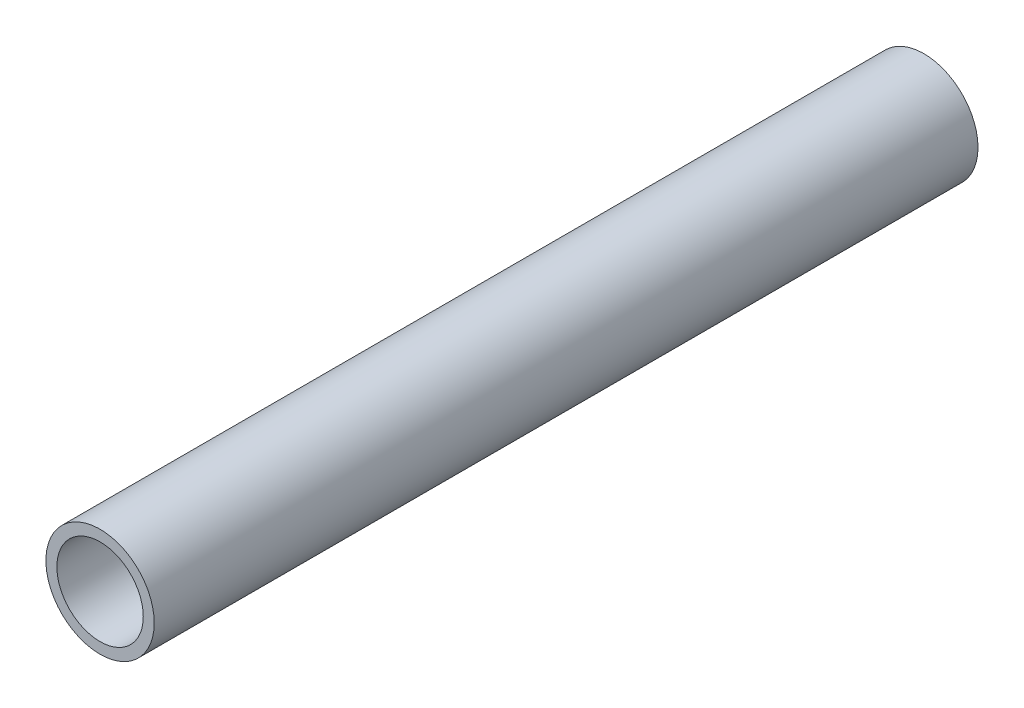
ISO-10303-21;
HEADER;
FILE_DESCRIPTION(('STEP AP214'),'2;1');
FILE_NAME('part.step','',(''),(''),'','','');
FILE_SCHEMA(('AUTOMOTIVE_DESIGN { 1 0 10303 214 1 1 1 1 }'));
ENDSEC;
DATA;
#1=APPLICATION_CONTEXT('core data for automotive mechanical design processes');
#2=APPLICATION_PROTOCOL_DEFINITION('international standard','automotive_design',2000,#1);
#3=PRODUCT_CONTEXT('',#1,'mechanical');
#4=PRODUCT('Part','Part','',(#3));
#5=PRODUCT_RELATED_PRODUCT_CATEGORY('part','',(#4));
#6=PRODUCT_DEFINITION_FORMATION('','',#4);
#7=PRODUCT_DEFINITION_CONTEXT('part definition',#1,'design');
#8=PRODUCT_DEFINITION('design','',#6,#7);
#9=PRODUCT_DEFINITION_SHAPE('','',#8);
#10=(LENGTH_UNIT() NAMED_UNIT(*) SI_UNIT(.MILLI.,.METRE.));
#11=(NAMED_UNIT(*) PLANE_ANGLE_UNIT() SI_UNIT($,.RADIAN.));
#12=(NAMED_UNIT(*) SI_UNIT($,.STERADIAN.) SOLID_ANGLE_UNIT());
#13=UNCERTAINTY_MEASURE_WITH_UNIT(LENGTH_MEASURE(1.E-05),#10,'distance_accuracy_value','');
#14=(GEOMETRIC_REPRESENTATION_CONTEXT(3) GLOBAL_UNCERTAINTY_ASSIGNED_CONTEXT((#13)) GLOBAL_UNIT_ASSIGNED_CONTEXT((#10,
#11,#12)) REPRESENTATION_CONTEXT('',''));
#15=CARTESIAN_POINT('',(0.,0.,0.));
#16=DIRECTION('',(0.,0.,1.));
#17=DIRECTION('',(1.,0.,0.));
#18=AXIS2_PLACEMENT_3D('',#15,#16,#17);
#19=CARTESIAN_POINT('',(0.,0.,127.));
#20=DIRECTION('',(0.,0.,1.));
#21=DIRECTION('',(1.,0.,0.));
#22=AXIS2_PLACEMENT_3D('',#19,#20,#21);
#23=PLANE('',#22);
#24=CARTESIAN_POINT('',(0.,0.,127.));
#25=DIRECTION('',(0.,0.,1.));
#26=DIRECTION('',(1.,0.,0.));
#27=AXIS2_PLACEMENT_3D('',#24,#25,#26);
#28=CIRCLE('',#27,16.7005);
#29=CARTESIAN_POINT('',(16.7005,0.,127.));
#30=VERTEX_POINT('',#29);
#31=EDGE_CURVE('E11',#30,#30,#28,.T.);
#32=ORIENTED_EDGE('',*,*,#31,.T.);
#33=EDGE_LOOP('',(#32));
#34=FACE_BOUND('',#33,.T.);
#35=CARTESIAN_POINT('',(0.,0.,127.));
#36=DIRECTION('',(0.,0.,1.));
#37=DIRECTION('',(1.,0.,0.));
#38=AXIS2_PLACEMENT_3D('',#35,#36,#37);
#39=CIRCLE('',#38,13.3223);
#40=CARTESIAN_POINT('',(13.3223,0.,127.));
#41=VERTEX_POINT('',#40);
#42=EDGE_CURVE('E48',#41,#41,#39,.T.);
#43=ORIENTED_EDGE('',*,*,#42,.F.);
#44=EDGE_LOOP('',(#43));
#45=FACE_BOUND('',#44,.T.);
#46=ADVANCED_FACE('F37',(#34,#45),#23,.T.);
#47=CARTESIAN_POINT('',(0.,0.,-127.));
#48=DIRECTION('',(0.,0.,1.));
#49=DIRECTION('',(1.,0.,0.));
#50=AXIS2_PLACEMENT_3D('',#47,#48,#49);
#51=PLANE('',#50);
#52=CARTESIAN_POINT('',(0.,0.,-127.));
#53=DIRECTION('',(0.,0.,1.));
#54=DIRECTION('',(1.,0.,0.));
#55=AXIS2_PLACEMENT_3D('',#52,#53,#54);
#56=CIRCLE('',#55,16.7005);
#57=CARTESIAN_POINT('',(16.7005,0.,-127.));
#58=VERTEX_POINT('',#57);
#59=EDGE_CURVE('E41',#58,#58,#56,.T.);
#60=ORIENTED_EDGE('',*,*,#59,.F.);
#61=EDGE_LOOP('',(#60));
#62=FACE_BOUND('',#61,.T.);
#63=CARTESIAN_POINT('',(0.,0.,-127.));
#64=DIRECTION('',(0.,0.,1.));
#65=DIRECTION('',(1.,0.,0.));
#66=AXIS2_PLACEMENT_3D('',#63,#64,#65);
#67=CIRCLE('',#66,13.3223);
#68=CARTESIAN_POINT('',(13.3223,0.,-127.));
#69=VERTEX_POINT('',#68);
#70=EDGE_CURVE('E50',#69,#69,#67,.T.);
#71=ORIENTED_EDGE('',*,*,#70,.T.);
#72=EDGE_LOOP('',(#71));
#73=FACE_BOUND('',#72,.T.);
#74=ADVANCED_FACE('F60',(#62,#73),#51,.F.);
#75=CARTESIAN_POINT('',(0.,0.,127.));
#76=DIRECTION('',(0.,0.,-1.));
#77=DIRECTION('',(-1.,0.,0.));
#78=AXIS2_PLACEMENT_3D('',#75,#76,#77);
#79=CYLINDRICAL_SURFACE('',#78,16.7005);
#80=ORIENTED_EDGE('',*,*,#31,.F.);
#81=EDGE_LOOP('',(#80));
#82=FACE_BOUND('',#81,.T.);
#83=ORIENTED_EDGE('',*,*,#59,.T.);
#84=EDGE_LOOP('',(#83));
#85=FACE_BOUND('',#84,.T.);
#86=ADVANCED_FACE('F39',(#82,#85),#79,.T.);
#87=CARTESIAN_POINT('',(0.,0.,127.));
#88=DIRECTION('',(0.,0.,-1.));
#89=DIRECTION('',(-1.,0.,0.));
#90=AXIS2_PLACEMENT_3D('',#87,#88,#89);
#91=CYLINDRICAL_SURFACE('',#90,13.3223);
#92=ORIENTED_EDGE('',*,*,#42,.T.);
#93=EDGE_LOOP('',(#92));
#94=FACE_BOUND('',#93,.T.);
#95=ORIENTED_EDGE('',*,*,#70,.F.);
#96=EDGE_LOOP('',(#95));
#97=FACE_BOUND('',#96,.T.);
#98=ADVANCED_FACE('F56',(#94,#97),#91,.F.);
#99=CLOSED_SHELL('',(#46,#74,#86,#98));
#100=MANIFOLD_SOLID_BREP('B2',#99);
#101=ADVANCED_BREP_SHAPE_REPRESENTATION('',(#18,#100),#14);
#102=SHAPE_DEFINITION_REPRESENTATION(#9,#101);
ENDSEC;
END-ISO-10303-21;
